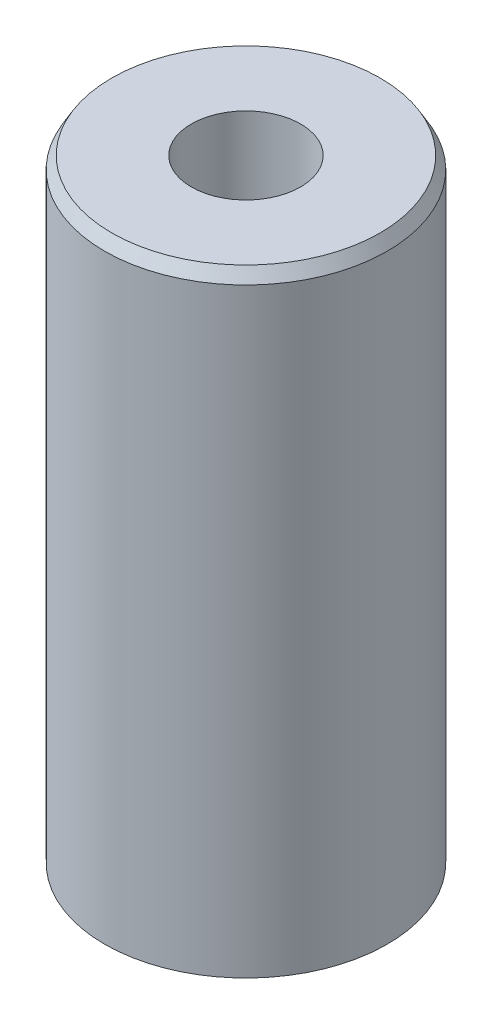
ISO-10303-21;
HEADER;
FILE_DESCRIPTION(('STEP AP214'),'2;1');
FILE_NAME('part.step','',(''),(''),'','','');
FILE_SCHEMA(('AUTOMOTIVE_DESIGN { 1 0 10303 214 1 1 1 1 }'));
ENDSEC;
DATA;
#1=APPLICATION_CONTEXT('core data for automotive mechanical design processes');
#2=APPLICATION_PROTOCOL_DEFINITION('international standard','automotive_design',2000,#1);
#3=PRODUCT_CONTEXT('',#1,'mechanical');
#4=PRODUCT('Part','Part','',(#3));
#5=PRODUCT_RELATED_PRODUCT_CATEGORY('part','',(#4));
#6=PRODUCT_DEFINITION_FORMATION('','',#4);
#7=PRODUCT_DEFINITION_CONTEXT('part definition',#1,'design');
#8=PRODUCT_DEFINITION('design','',#6,#7);
#9=PRODUCT_DEFINITION_SHAPE('','',#8);
#10=(LENGTH_UNIT() NAMED_UNIT(*) SI_UNIT(.MILLI.,.METRE.));
#11=(NAMED_UNIT(*) PLANE_ANGLE_UNIT() SI_UNIT($,.RADIAN.));
#12=(NAMED_UNIT(*) SI_UNIT($,.STERADIAN.) SOLID_ANGLE_UNIT());
#13=UNCERTAINTY_MEASURE_WITH_UNIT(LENGTH_MEASURE(1.E-05),#10,'distance_accuracy_value','');
#14=(GEOMETRIC_REPRESENTATION_CONTEXT(3) GLOBAL_UNCERTAINTY_ASSIGNED_CONTEXT((#13)) GLOBAL_UNIT_ASSIGNED_CONTEXT((#10,
#11,#12)) REPRESENTATION_CONTEXT('',''));
#15=CARTESIAN_POINT('',(0.,0.,0.));
#16=DIRECTION('',(0.,0.,1.));
#17=DIRECTION('',(1.,0.,0.));
#18=AXIS2_PLACEMENT_3D('',#15,#16,#17);
#19=CARTESIAN_POINT('',(0.,164.434164135076,0.));
#20=DIRECTION('',(0.,-1.,0.));
#21=DIRECTION('',(0.,0.,-1.));
#22=AXIS2_PLACEMENT_3D('',#19,#20,#21);
#23=CYLINDRICAL_SURFACE('',#22,37.5);
#24=CARTESIAN_POINT('',(0.,161.172333949418,0.));
#25=DIRECTION('',(0.,1.,0.));
#26=DIRECTION('',(0.,0.,1.));
#27=AXIS2_PLACEMENT_3D('',#24,#25,#26);
#28=CIRCLE('',#27,37.5);
#29=CARTESIAN_POINT('',(0.,161.172333949418,37.5));
#30=VERTEX_POINT('',#29);
#31=EDGE_CURVE('E50',#30,#30,#28,.F.);
#32=ORIENTED_EDGE('',*,*,#31,.T.);
#33=EDGE_LOOP('',(#32));
#34=FACE_BOUND('',#33,.T.);
#35=CARTESIAN_POINT('',(0.,1.88321853574044,0.));
#36=DIRECTION('',(0.,1.,0.));
#37=DIRECTION('',(0.,0.,1.));
#38=AXIS2_PLACEMENT_3D('',#35,#36,#37);
#39=CIRCLE('',#38,37.5);
#40=CARTESIAN_POINT('',(0.,1.88321853574044,37.5));
#41=VERTEX_POINT('',#40);
#42=EDGE_CURVE('E51',#41,#41,#39,.T.);
#43=ORIENTED_EDGE('',*,*,#42,.T.);
#44=EDGE_LOOP('',(#43));
#45=FACE_BOUND('',#44,.T.);
#46=ADVANCED_FACE('F39',(#34,#45),#23,.T.);
#47=CARTESIAN_POINT('',(0.,164.434164135076,0.));
#48=DIRECTION('',(0.,1.,0.));
#49=DIRECTION('',(0.,0.,1.));
#50=AXIS2_PLACEMENT_3D('',#47,#48,#49);
#51=PLANE('',#50);
#52=CARTESIAN_POINT('',(0.,164.434164135076,0.));
#53=DIRECTION('',(0.,1.,0.));
#54=DIRECTION('',(0.,0.,1.));
#55=AXIS2_PLACEMENT_3D('',#52,#53,#54);
#56=CIRCLE('',#55,35.6167814642596);
#57=CARTESIAN_POINT('',(0.,164.434164135076,35.6167814642596));
#58=VERTEX_POINT('',#57);
#59=EDGE_CURVE('E54',#58,#58,#56,.T.);
#60=ORIENTED_EDGE('',*,*,#59,.T.);
#61=EDGE_LOOP('',(#60));
#62=FACE_BOUND('',#61,.T.);
#63=CARTESIAN_POINT('',(0.,164.434164135076,0.));
#64=DIRECTION('',(0.,1.,0.));
#65=DIRECTION('',(0.,0.,1.));
#66=AXIS2_PLACEMENT_3D('',#63,#64,#65);
#67=CIRCLE('',#66,14.4948205220561);
#68=CARTESIAN_POINT('',(0.,164.434164135076,14.4948205220561));
#69=VERTEX_POINT('',#68);
#70=EDGE_CURVE('E58',#69,#69,#67,.T.);
#71=ORIENTED_EDGE('',*,*,#70,.F.);
#72=EDGE_LOOP('',(#71));
#73=FACE_BOUND('',#72,.T.);
#74=ADVANCED_FACE('F69',(#62,#73),#51,.T.);
#75=CARTESIAN_POINT('',(0.,0.,0.));
#76=DIRECTION('',(0.,1.,0.));
#77=DIRECTION('',(0.,0.,1.));
#78=AXIS2_PLACEMENT_3D('',#75,#76,#77);
#79=PLANE('',#78);
#80=CARTESIAN_POINT('',(0.,0.,0.));
#81=DIRECTION('',(0.,1.,0.));
#82=DIRECTION('',(0.,0.,1.));
#83=AXIS2_PLACEMENT_3D('',#80,#81,#82);
#84=CIRCLE('',#83,34.2381698143421);
#85=CARTESIAN_POINT('',(0.,0.,34.2381698143421));
#86=VERTEX_POINT('',#85);
#87=EDGE_CURVE('E10',#86,#86,#84,.F.);
#88=ORIENTED_EDGE('',*,*,#87,.T.);
#89=EDGE_LOOP('',(#88));
#90=FACE_BOUND('',#89,.T.);
#91=CARTESIAN_POINT('',(0.,0.,0.));
#92=DIRECTION('',(0.,1.,0.));
#93=DIRECTION('',(0.,0.,1.));
#94=AXIS2_PLACEMENT_3D('',#91,#92,#93);
#95=CIRCLE('',#94,14.4948205220561);
#96=CARTESIAN_POINT('',(0.,0.,14.4948205220561));
#97=VERTEX_POINT('',#96);
#98=EDGE_CURVE('E63',#97,#97,#95,.T.);
#99=ORIENTED_EDGE('',*,*,#98,.T.);
#100=EDGE_LOOP('',(#99));
#101=FACE_BOUND('',#100,.T.);
#102=ADVANCED_FACE('F75',(#90,#101),#79,.F.);
#103=CARTESIAN_POINT('',(0.,164.434164135076,0.));
#104=DIRECTION('',(0.,-1.,0.));
#105=DIRECTION('',(0.,0.,-1.));
#106=AXIS2_PLACEMENT_3D('',#103,#104,#105);
#107=CYLINDRICAL_SURFACE('',#106,14.4948205220561);
#108=ORIENTED_EDGE('',*,*,#70,.T.);
#109=EDGE_LOOP('',(#108));
#110=FACE_BOUND('',#109,.T.);
#111=ORIENTED_EDGE('',*,*,#98,.F.);
#112=EDGE_LOOP('',(#111));
#113=FACE_BOUND('',#112,.T.);
#114=ADVANCED_FACE('F70',(#110,#113),#107,.F.);
#115=CARTESIAN_POINT('',(0.,164.434164135076,0.));
#116=DIRECTION('',(0.,-1.,0.));
#117=DIRECTION('',(0.,0.,-1.));
#118=AXIS2_PLACEMENT_3D('',#115,#116,#117);
#119=CONICAL_SURFACE('',#118,35.6167814642596,0.523598775598291);
#120=ORIENTED_EDGE('',*,*,#31,.F.);
#121=EDGE_LOOP('',(#120));
#122=FACE_BOUND('',#121,.T.);
#123=ORIENTED_EDGE('',*,*,#59,.F.);
#124=EDGE_LOOP('',(#123));
#125=FACE_BOUND('',#124,.T.);
#126=ADVANCED_FACE('F81',(#122,#125),#119,.T.);
#127=CARTESIAN_POINT('',(0.,1.88321853574044,0.));
#128=DIRECTION('',(0.,1.,0.));
#129=DIRECTION('',(0.,0.,1.));
#130=AXIS2_PLACEMENT_3D('',#127,#128,#129);
#131=CONICAL_SURFACE('',#130,37.5,1.0471975511966);
#132=ORIENTED_EDGE('',*,*,#87,.F.);
#133=EDGE_LOOP('',(#132));
#134=FACE_BOUND('',#133,.T.);
#135=ORIENTED_EDGE('',*,*,#42,.F.);
#136=EDGE_LOOP('',(#135));
#137=FACE_BOUND('',#136,.T.);
#138=ADVANCED_FACE('F45',(#134,#137),#131,.T.);
#139=CLOSED_SHELL('',(#46,#74,#102,#114,#126,#138));
#140=MANIFOLD_SOLID_BREP('B2',#139);
#141=ADVANCED_BREP_SHAPE_REPRESENTATION('',(#18,#140),#14);
#142=SHAPE_DEFINITION_REPRESENTATION(#9,#141);
ENDSEC;
END-ISO-10303-21;
